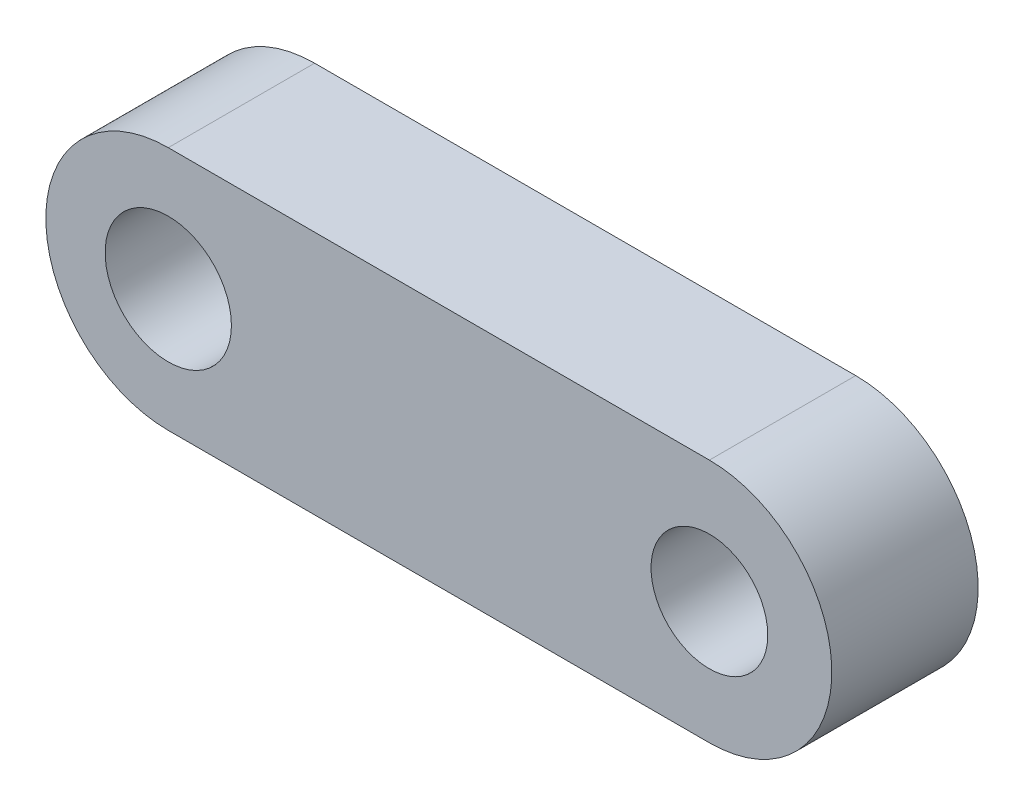
ISO-10303-21;
HEADER;
FILE_DESCRIPTION(('STEP AP214'),'2;1');
FILE_NAME('part.step','',(''),(''),'','','');
FILE_SCHEMA(('AUTOMOTIVE_DESIGN { 1 0 10303 214 1 1 1 1 }'));
ENDSEC;
DATA;
#1=APPLICATION_CONTEXT('core data for automotive mechanical design processes');
#2=APPLICATION_PROTOCOL_DEFINITION('international standard','automotive_design',2000,#1);
#3=PRODUCT_CONTEXT('',#1,'mechanical');
#4=PRODUCT('Part','Part','',(#3));
#5=PRODUCT_RELATED_PRODUCT_CATEGORY('part','',(#4));
#6=PRODUCT_DEFINITION_FORMATION('','',#4);
#7=PRODUCT_DEFINITION_CONTEXT('part definition',#1,'design');
#8=PRODUCT_DEFINITION('design','',#6,#7);
#9=PRODUCT_DEFINITION_SHAPE('','',#8);
#10=(LENGTH_UNIT() NAMED_UNIT(*) SI_UNIT(.MILLI.,.METRE.));
#11=(NAMED_UNIT(*) PLANE_ANGLE_UNIT() SI_UNIT($,.RADIAN.));
#12=(NAMED_UNIT(*) SI_UNIT($,.STERADIAN.) SOLID_ANGLE_UNIT());
#13=UNCERTAINTY_MEASURE_WITH_UNIT(LENGTH_MEASURE(1.E-05),#10,'distance_accuracy_value','');
#14=(GEOMETRIC_REPRESENTATION_CONTEXT(3) GLOBAL_UNCERTAINTY_ASSIGNED_CONTEXT((#13)) GLOBAL_UNIT_ASSIGNED_CONTEXT((#10,
#11,#12)) REPRESENTATION_CONTEXT('',''));
#15=CARTESIAN_POINT('',(0.,0.,0.));
#16=DIRECTION('',(0.,0.,1.));
#17=DIRECTION('',(1.,0.,0.));
#18=AXIS2_PLACEMENT_3D('',#15,#16,#17);
#19=CARTESIAN_POINT('',(-61.0175496199846,0.,33.));
#20=DIRECTION('',(0.,0.,1.));
#21=DIRECTION('',(1.,0.,0.));
#22=AXIS2_PLACEMENT_3D('',#19,#20,#21);
#23=PLANE('',#22);
#24=CARTESIAN_POINT('',(-61.0175496199846,0.,33.));
#25=DIRECTION('',(0.,0.,1.));
#26=DIRECTION('',(1.,0.,0.));
#27=AXIS2_PLACEMENT_3D('',#24,#25,#26);
#28=CIRCLE('',#27,14.2382511538763);
#29=CARTESIAN_POINT('',(-46.7792984661082,0.,33.));
#30=VERTEX_POINT('',#29);
#31=EDGE_CURVE('E100',#30,#30,#28,.T.);
#32=ORIENTED_EDGE('',*,*,#31,.F.);
#33=EDGE_LOOP('',(#32));
#34=FACE_BOUND('',#33,.T.);
#35=CARTESIAN_POINT('',(-61.0175496199846,0.,33.));
#36=DIRECTION('',(0.,0.,1.));
#37=DIRECTION('',(1.,0.,0.));
#38=AXIS2_PLACEMENT_3D('',#35,#36,#37);
#39=CIRCLE('',#38,27.6104956578299);
#40=CARTESIAN_POINT('',(-61.0175496199846,27.6104956578299,33.));
#41=VERTEX_POINT('',#40);
#42=CARTESIAN_POINT('',(-61.0175496199846,-27.6104956578299,33.));
#43=VERTEX_POINT('',#42);
#44=EDGE_CURVE('E85',#41,#43,#39,.T.);
#45=ORIENTED_EDGE('',*,*,#44,.T.);
#46=DIRECTION('',(1.,0.,0.));
#47=VECTOR('',#46,1.);
#48=CARTESIAN_POINT('',(61.0175496199846,-27.6104956578299,33.));
#49=LINE('',#48,#47);
#50=CARTESIAN_POINT('',(61.0175496199846,-27.6104956578299,33.));
#51=VERTEX_POINT('',#50);
#52=EDGE_CURVE('E80',#43,#51,#49,.T.);
#53=ORIENTED_EDGE('',*,*,#52,.T.);
#54=CARTESIAN_POINT('',(61.0175496199846,0.,33.));
#55=DIRECTION('',(0.,0.,1.));
#56=DIRECTION('',(-1.,0.,0.));
#57=AXIS2_PLACEMENT_3D('',#54,#55,#56);
#58=CIRCLE('',#57,27.6104956578299);
#59=CARTESIAN_POINT('',(61.0175496199846,27.6104956578299,33.));
#60=VERTEX_POINT('',#59);
#61=EDGE_CURVE('E83',#51,#60,#58,.T.);
#62=ORIENTED_EDGE('',*,*,#61,.T.);
#63=DIRECTION('',(-1.,0.,0.));
#64=VECTOR('',#63,1.);
#65=CARTESIAN_POINT('',(-61.0175496199846,27.6104956578299,33.));
#66=LINE('',#65,#64);
#67=EDGE_CURVE('E50',#60,#41,#66,.T.);
#68=ORIENTED_EDGE('',*,*,#67,.T.);
#69=EDGE_LOOP('',(#45,#53,#62,#68));
#70=FACE_BOUND('',#69,.T.);
#71=CARTESIAN_POINT('',(61.0175496199846,0.,33.));
#72=DIRECTION('',(0.,0.,1.));
#73=DIRECTION('',(1.,0.,0.));
#74=AXIS2_PLACEMENT_3D('',#71,#72,#73);
#75=CIRCLE('',#74,13.1589703776762);
#76=CARTESIAN_POINT('',(74.1765199976608,0.,33.));
#77=VERTEX_POINT('',#76);
#78=EDGE_CURVE('E115',#77,#77,#75,.T.);
#79=ORIENTED_EDGE('',*,*,#78,.F.);
#80=EDGE_LOOP('',(#79));
#81=FACE_BOUND('',#80,.T.);
#82=ADVANCED_FACE('F33',(#34,#70,#81),#23,.T.);
#83=CARTESIAN_POINT('',(-61.0175496199846,0.,0.));
#84=DIRECTION('',(0.,0.,1.));
#85=DIRECTION('',(1.,0.,0.));
#86=AXIS2_PLACEMENT_3D('',#83,#84,#85);
#87=PLANE('',#86);
#88=CARTESIAN_POINT('',(-61.0175496199846,0.,0.));
#89=DIRECTION('',(0.,0.,1.));
#90=DIRECTION('',(1.,0.,0.));
#91=AXIS2_PLACEMENT_3D('',#88,#89,#90);
#92=CIRCLE('',#91,27.6104956578299);
#93=CARTESIAN_POINT('',(-61.0175496199846,27.6104956578299,0.));
#94=VERTEX_POINT('',#93);
#95=CARTESIAN_POINT('',(-61.0175496199846,-27.6104956578299,0.));
#96=VERTEX_POINT('',#95);
#97=EDGE_CURVE('E97',#94,#96,#92,.T.);
#98=ORIENTED_EDGE('',*,*,#97,.F.);
#99=DIRECTION('',(-1.,0.,0.));
#100=VECTOR('',#99,1.);
#101=CARTESIAN_POINT('',(-61.0175496199846,27.6104956578299,0.));
#102=LINE('',#101,#100);
#103=CARTESIAN_POINT('',(61.0175496199846,27.6104956578299,0.));
#104=VERTEX_POINT('',#103);
#105=EDGE_CURVE('E73',#104,#94,#102,.T.);
#106=ORIENTED_EDGE('',*,*,#105,.F.);
#107=CARTESIAN_POINT('',(61.0175496199846,0.,0.));
#108=DIRECTION('',(0.,0.,1.));
#109=DIRECTION('',(-1.,0.,0.));
#110=AXIS2_PLACEMENT_3D('',#107,#108,#109);
#111=CIRCLE('',#110,27.6104956578299);
#112=CARTESIAN_POINT('',(61.0175496199846,-27.6104956578299,0.));
#113=VERTEX_POINT('',#112);
#114=EDGE_CURVE('E67',#113,#104,#111,.T.);
#115=ORIENTED_EDGE('',*,*,#114,.F.);
#116=DIRECTION('',(1.,0.,0.));
#117=VECTOR('',#116,1.);
#118=CARTESIAN_POINT('',(61.0175496199846,-27.6104956578299,0.));
#119=LINE('',#118,#117);
#120=EDGE_CURVE('E89',#96,#113,#119,.T.);
#121=ORIENTED_EDGE('',*,*,#120,.F.);
#122=EDGE_LOOP('',(#98,#106,#115,#121));
#123=FACE_BOUND('',#122,.T.);
#124=CARTESIAN_POINT('',(-61.0175496199846,0.,0.));
#125=DIRECTION('',(0.,0.,1.));
#126=DIRECTION('',(1.,0.,0.));
#127=AXIS2_PLACEMENT_3D('',#124,#125,#126);
#128=CIRCLE('',#127,14.2382511538763);
#129=CARTESIAN_POINT('',(-46.7792984661082,0.,0.));
#130=VERTEX_POINT('',#129);
#131=EDGE_CURVE('E112',#130,#130,#128,.T.);
#132=ORIENTED_EDGE('',*,*,#131,.T.);
#133=EDGE_LOOP('',(#132));
#134=FACE_BOUND('',#133,.T.);
#135=CARTESIAN_POINT('',(61.0175496199846,0.,0.));
#136=DIRECTION('',(0.,0.,1.));
#137=DIRECTION('',(1.,0.,0.));
#138=AXIS2_PLACEMENT_3D('',#135,#136,#137);
#139=CIRCLE('',#138,13.1589703776762);
#140=CARTESIAN_POINT('',(74.1765199976608,0.,0.));
#141=VERTEX_POINT('',#140);
#142=EDGE_CURVE('E118',#141,#141,#139,.T.);
#143=ORIENTED_EDGE('',*,*,#142,.T.);
#144=EDGE_LOOP('',(#143));
#145=FACE_BOUND('',#144,.T.);
#146=ADVANCED_FACE('F108',(#123,#134,#145),#87,.F.);
#147=CARTESIAN_POINT('',(-61.0175496199846,0.,33.));
#148=DIRECTION('',(0.,0.,-1.));
#149=DIRECTION('',(-1.,0.,0.));
#150=AXIS2_PLACEMENT_3D('',#147,#148,#149);
#151=CYLINDRICAL_SURFACE('',#150,27.6104956578299);
#152=ORIENTED_EDGE('',*,*,#97,.T.);
#153=DIRECTION('',(0.,0.,-1.));
#154=VECTOR('',#153,1.);
#155=CARTESIAN_POINT('',(-61.0175496199846,-27.6104956578299,33.));
#156=LINE('',#155,#154);
#157=EDGE_CURVE('E11',#43,#96,#156,.T.);
#158=ORIENTED_EDGE('',*,*,#157,.F.);
#159=ORIENTED_EDGE('',*,*,#44,.F.);
#160=DIRECTION('',(0.,0.,-1.));
#161=VECTOR('',#160,1.);
#162=CARTESIAN_POINT('',(-61.0175496199846,27.6104956578299,33.));
#163=LINE('',#162,#161);
#164=EDGE_CURVE('E93',#41,#94,#163,.T.);
#165=ORIENTED_EDGE('',*,*,#164,.T.);
#166=EDGE_LOOP('',(#152,#158,#159,#165));
#167=FACE_BOUND('',#166,.T.);
#168=ADVANCED_FACE('F35',(#167),#151,.T.);
#169=CARTESIAN_POINT('',(61.0175496199846,-27.6104956578299,33.));
#170=DIRECTION('',(0.,1.,0.));
#171=DIRECTION('',(0.,0.,1.));
#172=AXIS2_PLACEMENT_3D('',#169,#170,#171);
#173=PLANE('',#172);
#174=ORIENTED_EDGE('',*,*,#120,.T.);
#175=DIRECTION('',(0.,0.,-1.));
#176=VECTOR('',#175,1.);
#177=CARTESIAN_POINT('',(61.0175496199846,-27.6104956578299,33.));
#178=LINE('',#177,#176);
#179=EDGE_CURVE('E42',#51,#113,#178,.T.);
#180=ORIENTED_EDGE('',*,*,#179,.F.);
#181=ORIENTED_EDGE('',*,*,#52,.F.);
#182=ORIENTED_EDGE('',*,*,#157,.T.);
#183=EDGE_LOOP('',(#174,#180,#181,#182));
#184=FACE_BOUND('',#183,.T.);
#185=ADVANCED_FACE('F88',(#184),#173,.F.);
#186=CARTESIAN_POINT('',(61.0175496199846,0.,33.));
#187=DIRECTION('',(0.,0.,-1.));
#188=DIRECTION('',(-1.,0.,0.));
#189=AXIS2_PLACEMENT_3D('',#186,#187,#188);
#190=CYLINDRICAL_SURFACE('',#189,27.6104956578299);
#191=ORIENTED_EDGE('',*,*,#114,.T.);
#192=DIRECTION('',(0.,0.,-1.));
#193=VECTOR('',#192,1.);
#194=CARTESIAN_POINT('',(61.0175496199846,27.6104956578299,33.));
#195=LINE('',#194,#193);
#196=EDGE_CURVE('E90',#60,#104,#195,.T.);
#197=ORIENTED_EDGE('',*,*,#196,.F.);
#198=ORIENTED_EDGE('',*,*,#61,.F.);
#199=ORIENTED_EDGE('',*,*,#179,.T.);
#200=EDGE_LOOP('',(#191,#197,#198,#199));
#201=FACE_BOUND('',#200,.T.);
#202=ADVANCED_FACE('F91',(#201),#190,.T.);
#203=CARTESIAN_POINT('',(-61.0175496199846,27.6104956578299,33.));
#204=DIRECTION('',(0.,-1.,0.));
#205=DIRECTION('',(0.,0.,-1.));
#206=AXIS2_PLACEMENT_3D('',#203,#204,#205);
#207=PLANE('',#206);
#208=ORIENTED_EDGE('',*,*,#105,.T.);
#209=ORIENTED_EDGE('',*,*,#164,.F.);
#210=ORIENTED_EDGE('',*,*,#67,.F.);
#211=ORIENTED_EDGE('',*,*,#196,.T.);
#212=EDGE_LOOP('',(#208,#209,#210,#211));
#213=FACE_BOUND('',#212,.T.);
#214=ADVANCED_FACE('F105',(#213),#207,.F.);
#215=CARTESIAN_POINT('',(-61.0175496199846,0.,33.));
#216=DIRECTION('',(0.,0.,-1.));
#217=DIRECTION('',(-1.,0.,0.));
#218=AXIS2_PLACEMENT_3D('',#215,#216,#217);
#219=CYLINDRICAL_SURFACE('',#218,14.2382511538763);
#220=ORIENTED_EDGE('',*,*,#31,.T.);
#221=EDGE_LOOP('',(#220));
#222=FACE_BOUND('',#221,.T.);
#223=ORIENTED_EDGE('',*,*,#131,.F.);
#224=EDGE_LOOP('',(#223));
#225=FACE_BOUND('',#224,.T.);
#226=ADVANCED_FACE('F135',(#222,#225),#219,.F.);
#227=CARTESIAN_POINT('',(61.0175496199846,0.,33.));
#228=DIRECTION('',(0.,0.,-1.));
#229=DIRECTION('',(-1.,0.,0.));
#230=AXIS2_PLACEMENT_3D('',#227,#228,#229);
#231=CYLINDRICAL_SURFACE('',#230,13.1589703776762);
#232=ORIENTED_EDGE('',*,*,#78,.T.);
#233=EDGE_LOOP('',(#232));
#234=FACE_BOUND('',#233,.T.);
#235=ORIENTED_EDGE('',*,*,#142,.F.);
#236=EDGE_LOOP('',(#235));
#237=FACE_BOUND('',#236,.T.);
#238=ADVANCED_FACE('F124',(#234,#237),#231,.F.);
#239=CLOSED_SHELL('',(#82,#146,#168,#185,#202,#214,#226,#238));
#240=MANIFOLD_SOLID_BREP('B2',#239);
#241=ADVANCED_BREP_SHAPE_REPRESENTATION('',(#18,#240),#14);
#242=SHAPE_DEFINITION_REPRESENTATION(#9,#241);
ENDSEC;
END-ISO-10303-21;
